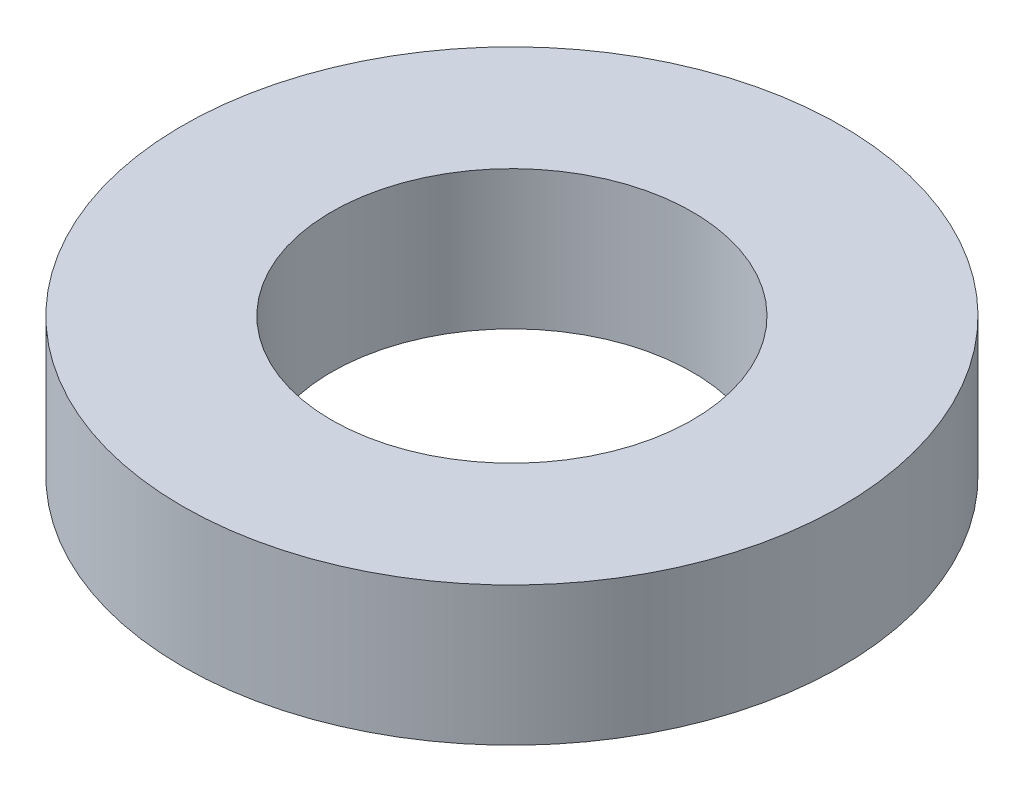
ISO-10303-21;
HEADER;
FILE_DESCRIPTION(('STEP AP214'),'2;1');
FILE_NAME('part.step','',(''),(''),'','','');
FILE_SCHEMA(('AUTOMOTIVE_DESIGN { 1 0 10303 214 1 1 1 1 }'));
ENDSEC;
DATA;
#1=APPLICATION_CONTEXT('core data for automotive mechanical design processes');
#2=APPLICATION_PROTOCOL_DEFINITION('international standard','automotive_design',2000,#1);
#3=PRODUCT_CONTEXT('',#1,'mechanical');
#4=PRODUCT('Part','Part','',(#3));
#5=PRODUCT_RELATED_PRODUCT_CATEGORY('part','',(#4));
#6=PRODUCT_DEFINITION_FORMATION('','',#4);
#7=PRODUCT_DEFINITION_CONTEXT('part definition',#1,'design');
#8=PRODUCT_DEFINITION('design','',#6,#7);
#9=PRODUCT_DEFINITION_SHAPE('','',#8);
#10=(LENGTH_UNIT() NAMED_UNIT(*) SI_UNIT(.MILLI.,.METRE.));
#11=(NAMED_UNIT(*) PLANE_ANGLE_UNIT() SI_UNIT($,.RADIAN.));
#12=(NAMED_UNIT(*) SI_UNIT($,.STERADIAN.) SOLID_ANGLE_UNIT());
#13=UNCERTAINTY_MEASURE_WITH_UNIT(LENGTH_MEASURE(1.E-05),#10,'distance_accuracy_value','');
#14=(GEOMETRIC_REPRESENTATION_CONTEXT(3) GLOBAL_UNCERTAINTY_ASSIGNED_CONTEXT((#13)) GLOBAL_UNIT_ASSIGNED_CONTEXT((#10,
#11,#12)) REPRESENTATION_CONTEXT('',''));
#15=CARTESIAN_POINT('',(0.,0.,0.));
#16=DIRECTION('',(0.,0.,1.));
#17=DIRECTION('',(1.,0.,0.));
#18=AXIS2_PLACEMENT_3D('',#15,#16,#17);
#19=CARTESIAN_POINT('',(0.,2.,0.));
#20=DIRECTION('',(0.,1.,0.));
#21=DIRECTION('',(0.,0.,1.));
#22=AXIS2_PLACEMENT_3D('',#19,#20,#21);
#23=PLANE('',#22);
#24=CARTESIAN_POINT('',(0.,2.,0.));
#25=DIRECTION('',(0.,1.,0.));
#26=DIRECTION('',(0.,0.,1.));
#27=AXIS2_PLACEMENT_3D('',#24,#25,#26);
#28=CIRCLE('',#27,4.75);
#29=CARTESIAN_POINT('',(0.,2.,4.75));
#30=VERTEX_POINT('',#29);
#31=EDGE_CURVE('E10',#30,#30,#28,.T.);
#32=ORIENTED_EDGE('',*,*,#31,.T.);
#33=EDGE_LOOP('',(#32));
#34=FACE_BOUND('',#33,.T.);
#35=CARTESIAN_POINT('',(0.,2.,0.));
#36=DIRECTION('',(0.,1.,0.));
#37=DIRECTION('',(0.,0.,1.));
#38=AXIS2_PLACEMENT_3D('',#35,#36,#37);
#39=CIRCLE('',#38,2.6);
#40=CARTESIAN_POINT('',(0.,2.,2.6));
#41=VERTEX_POINT('',#40);
#42=EDGE_CURVE('E41',#41,#41,#39,.T.);
#43=ORIENTED_EDGE('',*,*,#42,.F.);
#44=EDGE_LOOP('',(#43));
#45=FACE_BOUND('',#44,.T.);
#46=ADVANCED_FACE('F30',(#34,#45),#23,.T.);
#47=CARTESIAN_POINT('',(0.,0.,0.));
#48=DIRECTION('',(0.,1.,0.));
#49=DIRECTION('',(0.,0.,1.));
#50=AXIS2_PLACEMENT_3D('',#47,#48,#49);
#51=PLANE('',#50);
#52=CARTESIAN_POINT('',(0.,0.,0.));
#53=DIRECTION('',(0.,1.,0.));
#54=DIRECTION('',(0.,0.,1.));
#55=AXIS2_PLACEMENT_3D('',#52,#53,#54);
#56=CIRCLE('',#55,4.75);
#57=CARTESIAN_POINT('',(0.,0.,4.75));
#58=VERTEX_POINT('',#57);
#59=EDGE_CURVE('E34',#58,#58,#56,.T.);
#60=ORIENTED_EDGE('',*,*,#59,.F.);
#61=EDGE_LOOP('',(#60));
#62=FACE_BOUND('',#61,.T.);
#63=CARTESIAN_POINT('',(0.,0.,0.));
#64=DIRECTION('',(0.,1.,0.));
#65=DIRECTION('',(0.,0.,1.));
#66=AXIS2_PLACEMENT_3D('',#63,#64,#65);
#67=CIRCLE('',#66,2.6);
#68=CARTESIAN_POINT('',(0.,0.,2.6));
#69=VERTEX_POINT('',#68);
#70=EDGE_CURVE('E43',#69,#69,#67,.T.);
#71=ORIENTED_EDGE('',*,*,#70,.T.);
#72=EDGE_LOOP('',(#71));
#73=FACE_BOUND('',#72,.T.);
#74=ADVANCED_FACE('F53',(#62,#73),#51,.F.);
#75=CARTESIAN_POINT('',(0.,2.,0.));
#76=DIRECTION('',(0.,-1.,0.));
#77=DIRECTION('',(0.,0.,-1.));
#78=AXIS2_PLACEMENT_3D('',#75,#76,#77);
#79=CYLINDRICAL_SURFACE('',#78,4.75);
#80=ORIENTED_EDGE('',*,*,#31,.F.);
#81=EDGE_LOOP('',(#80));
#82=FACE_BOUND('',#81,.T.);
#83=ORIENTED_EDGE('',*,*,#59,.T.);
#84=EDGE_LOOP('',(#83));
#85=FACE_BOUND('',#84,.T.);
#86=ADVANCED_FACE('F32',(#82,#85),#79,.T.);
#87=CARTESIAN_POINT('',(0.,2.,0.));
#88=DIRECTION('',(0.,-1.,0.));
#89=DIRECTION('',(0.,0.,-1.));
#90=AXIS2_PLACEMENT_3D('',#87,#88,#89);
#91=CYLINDRICAL_SURFACE('',#90,2.6);
#92=ORIENTED_EDGE('',*,*,#42,.T.);
#93=EDGE_LOOP('',(#92));
#94=FACE_BOUND('',#93,.T.);
#95=ORIENTED_EDGE('',*,*,#70,.F.);
#96=EDGE_LOOP('',(#95));
#97=FACE_BOUND('',#96,.T.);
#98=ADVANCED_FACE('F49',(#94,#97),#91,.F.);
#99=CLOSED_SHELL('',(#46,#74,#86,#98));
#100=MANIFOLD_SOLID_BREP('B2',#99);
#101=ADVANCED_BREP_SHAPE_REPRESENTATION('',(#18,#100),#14);
#102=SHAPE_DEFINITION_REPRESENTATION(#9,#101);
ENDSEC;
END-ISO-10303-21;
